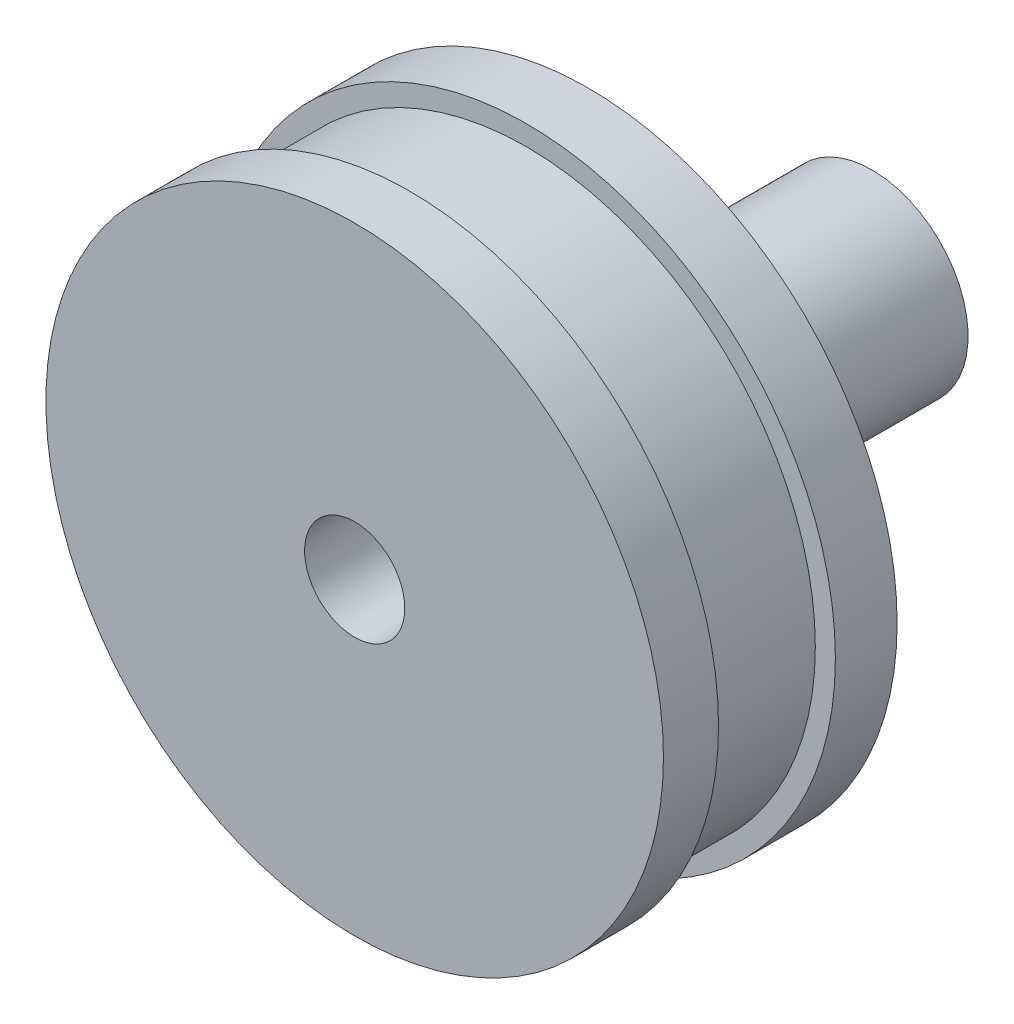
ISO-10303-21;
HEADER;
FILE_DESCRIPTION(('STEP AP214'),'2;1');
FILE_NAME('part.step','',(''),(''),'','','');
FILE_SCHEMA(('AUTOMOTIVE_DESIGN { 1 0 10303 214 1 1 1 1 }'));
ENDSEC;
DATA;
#1=APPLICATION_CONTEXT('core data for automotive mechanical design processes');
#2=APPLICATION_PROTOCOL_DEFINITION('international standard','automotive_design',2000,#1);
#3=PRODUCT_CONTEXT('',#1,'mechanical');
#4=PRODUCT('Part','Part','',(#3));
#5=PRODUCT_RELATED_PRODUCT_CATEGORY('part','',(#4));
#6=PRODUCT_DEFINITION_FORMATION('','',#4);
#7=PRODUCT_DEFINITION_CONTEXT('part definition',#1,'design');
#8=PRODUCT_DEFINITION('design','',#6,#7);
#9=PRODUCT_DEFINITION_SHAPE('','',#8);
#10=(LENGTH_UNIT() NAMED_UNIT(*) SI_UNIT(.MILLI.,.METRE.));
#11=(NAMED_UNIT(*) PLANE_ANGLE_UNIT() SI_UNIT($,.RADIAN.));
#12=(NAMED_UNIT(*) SI_UNIT($,.STERADIAN.) SOLID_ANGLE_UNIT());
#13=UNCERTAINTY_MEASURE_WITH_UNIT(LENGTH_MEASURE(1.E-05),#10,'distance_accuracy_value','');
#14=(GEOMETRIC_REPRESENTATION_CONTEXT(3) GLOBAL_UNCERTAINTY_ASSIGNED_CONTEXT((#13)) GLOBAL_UNIT_ASSIGNED_CONTEXT((#10,
#11,#12)) REPRESENTATION_CONTEXT('',''));
#15=CARTESIAN_POINT('',(0.,0.,0.));
#16=DIRECTION('',(0.,0.,1.));
#17=DIRECTION('',(1.,0.,0.));
#18=AXIS2_PLACEMENT_3D('',#15,#16,#17);
#19=CARTESIAN_POINT('',(0.,0.,14.));
#20=DIRECTION('',(0.,0.,-1.));
#21=DIRECTION('',(-1.,0.,0.));
#22=AXIS2_PLACEMENT_3D('',#19,#20,#21);
#23=CYLINDRICAL_SURFACE('',#22,18.5);
#24=CARTESIAN_POINT('',(0.,0.,0.));
#25=DIRECTION('',(0.,0.,1.));
#26=DIRECTION('',(1.,0.,0.));
#27=AXIS2_PLACEMENT_3D('',#24,#25,#26);
#28=CIRCLE('',#27,18.5);
#29=CARTESIAN_POINT('',(18.5,0.,0.));
#30=VERTEX_POINT('',#29);
#31=EDGE_CURVE('E68',#30,#30,#28,.T.);
#32=ORIENTED_EDGE('',*,*,#31,.T.);
#33=EDGE_LOOP('',(#32));
#34=FACE_BOUND('',#33,.T.);
#35=CARTESIAN_POINT('',(0.,0.,3.7));
#36=DIRECTION('',(0.,0.,1.));
#37=DIRECTION('',(1.,0.,0.));
#38=AXIS2_PLACEMENT_3D('',#35,#36,#37);
#39=CIRCLE('',#38,18.5);
#40=CARTESIAN_POINT('',(18.5,0.,3.7));
#41=VERTEX_POINT('',#40);
#42=EDGE_CURVE('E61',#41,#41,#39,.T.);
#43=ORIENTED_EDGE('',*,*,#42,.F.);
#44=EDGE_LOOP('',(#43));
#45=FACE_BOUND('',#44,.T.);
#46=ADVANCED_FACE('F33',(#34,#45),#23,.T.);
#47=CARTESIAN_POINT('',(0.,0.,14.));
#48=DIRECTION('',(0.,0.,1.));
#49=DIRECTION('',(1.,0.,0.));
#50=AXIS2_PLACEMENT_3D('',#47,#48,#49);
#51=PLANE('',#50);
#52=CARTESIAN_POINT('',(0.,0.,14.));
#53=DIRECTION('',(0.,0.,1.));
#54=DIRECTION('',(1.,0.,0.));
#55=AXIS2_PLACEMENT_3D('',#52,#53,#54);
#56=CIRCLE('',#55,18.5);
#57=CARTESIAN_POINT('',(18.5,0.,14.));
#58=VERTEX_POINT('',#57);
#59=EDGE_CURVE('E45',#58,#58,#56,.T.);
#60=ORIENTED_EDGE('',*,*,#59,.T.);
#61=EDGE_LOOP('',(#60));
#62=FACE_BOUND('',#61,.T.);
#63=CARTESIAN_POINT('',(0.,0.,14.));
#64=DIRECTION('',(0.,0.,1.));
#65=DIRECTION('',(1.,0.,0.));
#66=AXIS2_PLACEMENT_3D('',#63,#64,#65);
#67=CIRCLE('',#66,3.);
#68=CARTESIAN_POINT('',(3.,0.,14.));
#69=VERTEX_POINT('',#68);
#70=EDGE_CURVE('E65',#69,#69,#67,.T.);
#71=ORIENTED_EDGE('',*,*,#70,.F.);
#72=EDGE_LOOP('',(#71));
#73=FACE_BOUND('',#72,.T.);
#74=ADVANCED_FACE('F79',(#62,#73),#51,.T.);
#75=CARTESIAN_POINT('',(0.,0.,0.));
#76=DIRECTION('',(0.,0.,1.));
#77=DIRECTION('',(1.,0.,0.));
#78=AXIS2_PLACEMENT_3D('',#75,#76,#77);
#79=PLANE('',#78);
#80=CARTESIAN_POINT('',(0.,0.,0.));
#81=DIRECTION('',(0.,0.,1.));
#82=DIRECTION('',(1.,0.,0.));
#83=AXIS2_PLACEMENT_3D('',#80,#81,#82);
#84=CIRCLE('',#83,7.);
#85=CARTESIAN_POINT('',(7.,0.,0.));
#86=VERTEX_POINT('',#85);
#87=EDGE_CURVE('E37',#86,#86,#84,.F.);
#88=ORIENTED_EDGE('',*,*,#87,.F.);
#89=EDGE_LOOP('',(#88));
#90=FACE_BOUND('',#89,.T.);
#91=ORIENTED_EDGE('',*,*,#31,.F.);
#92=EDGE_LOOP('',(#91));
#93=FACE_BOUND('',#92,.T.);
#94=ADVANCED_FACE('F77',(#90,#93),#79,.F.);
#95=CARTESIAN_POINT('',(0.,0.,10.7));
#96=DIRECTION('',(0.,0.,1.));
#97=DIRECTION('',(1.,0.,0.));
#98=AXIS2_PLACEMENT_3D('',#95,#96,#97);
#99=CIRCLE('',#98,18.5);
#100=CARTESIAN_POINT('',(18.5,0.,10.7));
#101=VERTEX_POINT('',#100);
#102=EDGE_CURVE('E55',#101,#101,#99,.T.);
#103=ORIENTED_EDGE('',*,*,#102,.T.);
#104=EDGE_LOOP('',(#103));
#105=FACE_BOUND('',#104,.T.);
#106=ORIENTED_EDGE('',*,*,#59,.F.);
#107=EDGE_LOOP('',(#106));
#108=FACE_BOUND('',#107,.T.);
#109=ADVANCED_FACE('F35',(#105,#108),#23,.T.);
#110=CARTESIAN_POINT('',(0.,0.,14.));
#111=DIRECTION('',(0.,0.,-1.));
#112=DIRECTION('',(-1.,0.,0.));
#113=AXIS2_PLACEMENT_3D('',#110,#111,#112);
#114=CYLINDRICAL_SURFACE('',#113,3.);
#115=ORIENTED_EDGE('',*,*,#70,.T.);
#116=EDGE_LOOP('',(#115));
#117=FACE_BOUND('',#116,.T.);
#118=CARTESIAN_POINT('',(0.,0.,0.));
#119=DIRECTION('',(0.,0.,1.));
#120=DIRECTION('',(1.,0.,0.));
#121=AXIS2_PLACEMENT_3D('',#118,#119,#120);
#122=CIRCLE('',#121,3.);
#123=CARTESIAN_POINT('',(3.,0.,0.));
#124=VERTEX_POINT('',#123);
#125=EDGE_CURVE('E64',#124,#124,#122,.T.);
#126=ORIENTED_EDGE('',*,*,#125,.F.);
#127=EDGE_LOOP('',(#126));
#128=FACE_BOUND('',#127,.T.);
#129=ADVANCED_FACE('F85',(#117,#128),#114,.F.);
#130=CARTESIAN_POINT('',(0.,0.,5.5));
#131=DIRECTION('',(0.,0.,1.));
#132=DIRECTION('',(1.,0.,0.));
#133=AXIS2_PLACEMENT_3D('',#130,#131,#132);
#134=CYLINDRICAL_SURFACE('',#133,17.3);
#135=CARTESIAN_POINT('',(0.,0.,10.7));
#136=DIRECTION('',(0.,0.,1.));
#137=DIRECTION('',(1.,0.,0.));
#138=AXIS2_PLACEMENT_3D('',#135,#136,#137);
#139=CIRCLE('',#138,17.3);
#140=CARTESIAN_POINT('',(17.3,0.,10.7));
#141=VERTEX_POINT('',#140);
#142=EDGE_CURVE('E52',#141,#141,#139,.T.);
#143=ORIENTED_EDGE('',*,*,#142,.F.);
#144=EDGE_LOOP('',(#143));
#145=FACE_BOUND('',#144,.T.);
#146=CARTESIAN_POINT('',(0.,0.,3.7));
#147=DIRECTION('',(0.,0.,1.));
#148=DIRECTION('',(1.,0.,0.));
#149=AXIS2_PLACEMENT_3D('',#146,#147,#148);
#150=CIRCLE('',#149,17.3);
#151=CARTESIAN_POINT('',(17.3,0.,3.7));
#152=VERTEX_POINT('',#151);
#153=EDGE_CURVE('E58',#152,#152,#150,.T.);
#154=ORIENTED_EDGE('',*,*,#153,.T.);
#155=EDGE_LOOP('',(#154));
#156=FACE_BOUND('',#155,.T.);
#157=ADVANCED_FACE('F107',(#145,#156),#134,.T.);
#158=CARTESIAN_POINT('',(0.,0.,3.7));
#159=DIRECTION('',(0.,0.,1.));
#160=DIRECTION('',(1.,0.,0.));
#161=AXIS2_PLACEMENT_3D('',#158,#159,#160);
#162=PLANE('',#161);
#163=ORIENTED_EDGE('',*,*,#153,.F.);
#164=EDGE_LOOP('',(#163));
#165=FACE_BOUND('',#164,.T.);
#166=ORIENTED_EDGE('',*,*,#42,.T.);
#167=EDGE_LOOP('',(#166));
#168=FACE_BOUND('',#167,.T.);
#169=ADVANCED_FACE('F121',(#165,#168),#162,.T.);
#170=CARTESIAN_POINT('',(0.,0.,10.7));
#171=DIRECTION('',(0.,0.,1.));
#172=DIRECTION('',(1.,0.,0.));
#173=AXIS2_PLACEMENT_3D('',#170,#171,#172);
#174=PLANE('',#173);
#175=ORIENTED_EDGE('',*,*,#102,.F.);
#176=EDGE_LOOP('',(#175));
#177=FACE_BOUND('',#176,.T.);
#178=ORIENTED_EDGE('',*,*,#142,.T.);
#179=EDGE_LOOP('',(#178));
#180=FACE_BOUND('',#179,.T.);
#181=ADVANCED_FACE('F129',(#177,#180),#174,.F.);
#182=CARTESIAN_POINT('',(0.,0.,0.));
#183=DIRECTION('',(0.,0.,-1.));
#184=DIRECTION('',(-1.,0.,0.));
#185=AXIS2_PLACEMENT_3D('',#182,#183,#184);
#186=PLANE('',#185);
#187=ORIENTED_EDGE('',*,*,#125,.T.);
#188=EDGE_LOOP('',(#187));
#189=FACE_BOUND('',#188,.T.);
#190=ADVANCED_FACE('F136',(#189),#186,.F.);
#191=CARTESIAN_POINT('',(0.,0.,-5.));
#192=DIRECTION('',(0.,0.,1.));
#193=DIRECTION('',(1.,0.,0.));
#194=AXIS2_PLACEMENT_3D('',#191,#192,#193);
#195=CYLINDRICAL_SURFACE('',#194,7.);
#196=CARTESIAN_POINT('',(0.,0.,-5.));
#197=DIRECTION('',(0.,0.,-1.));
#198=DIRECTION('',(-1.,0.,0.));
#199=AXIS2_PLACEMENT_3D('',#196,#197,#198);
#200=CIRCLE('',#199,7.);
#201=CARTESIAN_POINT('',(-7.,0.,-5.));
#202=VERTEX_POINT('',#201);
#203=EDGE_CURVE('E49',#202,#202,#200,.T.);
#204=ORIENTED_EDGE('',*,*,#203,.F.);
#205=EDGE_LOOP('',(#204));
#206=FACE_BOUND('',#205,.T.);
#207=ORIENTED_EDGE('',*,*,#87,.T.);
#208=EDGE_LOOP('',(#207));
#209=FACE_BOUND('',#208,.T.);
#210=ADVANCED_FACE('F144',(#206,#209),#195,.T.);
#211=CARTESIAN_POINT('',(0.,0.,-5.));
#212=DIRECTION('',(0.,0.,-1.));
#213=DIRECTION('',(-1.,0.,0.));
#214=AXIS2_PLACEMENT_3D('',#211,#212,#213);
#215=PLANE('',#214);
#216=CARTESIAN_POINT('',(0.,0.,-5.));
#217=DIRECTION('',(0.,0.,-1.));
#218=DIRECTION('',(-1.,0.,0.));
#219=AXIS2_PLACEMENT_3D('',#216,#217,#218);
#220=CIRCLE('',#219,5.75);
#221=CARTESIAN_POINT('',(-5.75,0.,-5.));
#222=VERTEX_POINT('',#221);
#223=EDGE_CURVE('E10',#222,#222,#220,.T.);
#224=ORIENTED_EDGE('',*,*,#223,.F.);
#225=EDGE_LOOP('',(#224));
#226=FACE_BOUND('',#225,.T.);
#227=ORIENTED_EDGE('',*,*,#203,.T.);
#228=EDGE_LOOP('',(#227));
#229=FACE_BOUND('',#228,.T.);
#230=ADVANCED_FACE('F152',(#226,#229),#215,.T.);
#231=CARTESIAN_POINT('',(0.,0.,-17.));
#232=DIRECTION('',(0.,0.,1.));
#233=DIRECTION('',(1.,0.,0.));
#234=AXIS2_PLACEMENT_3D('',#231,#232,#233);
#235=CYLINDRICAL_SURFACE('',#234,5.75);
#236=CARTESIAN_POINT('',(0.,0.,-17.));
#237=DIRECTION('',(0.,0.,-1.));
#238=DIRECTION('',(-1.,0.,0.));
#239=AXIS2_PLACEMENT_3D('',#236,#237,#238);
#240=CIRCLE('',#239,5.75);
#241=CARTESIAN_POINT('',(-5.75,0.,-17.));
#242=VERTEX_POINT('',#241);
#243=EDGE_CURVE('E48',#242,#242,#240,.T.);
#244=ORIENTED_EDGE('',*,*,#243,.F.);
#245=EDGE_LOOP('',(#244));
#246=FACE_BOUND('',#245,.T.);
#247=ORIENTED_EDGE('',*,*,#223,.T.);
#248=EDGE_LOOP('',(#247));
#249=FACE_BOUND('',#248,.T.);
#250=ADVANCED_FACE('F160',(#246,#249),#235,.T.);
#251=CARTESIAN_POINT('',(0.,0.,-17.));
#252=DIRECTION('',(0.,0.,-1.));
#253=DIRECTION('',(-1.,0.,0.));
#254=AXIS2_PLACEMENT_3D('',#251,#252,#253);
#255=PLANE('',#254);
#256=ORIENTED_EDGE('',*,*,#243,.T.);
#257=EDGE_LOOP('',(#256));
#258=FACE_BOUND('',#257,.T.);
#259=ADVANCED_FACE('F168',(#258),#255,.T.);
#260=CLOSED_SHELL('',(#46,#74,#94,#109,#129,#157,#169,#181,#190,#210,#230,#250,#259));
#261=MANIFOLD_SOLID_BREP('B2',#260);
#262=ADVANCED_BREP_SHAPE_REPRESENTATION('',(#18,#261),#14);
#263=SHAPE_DEFINITION_REPRESENTATION(#9,#262);
ENDSEC;
END-ISO-10303-21;
